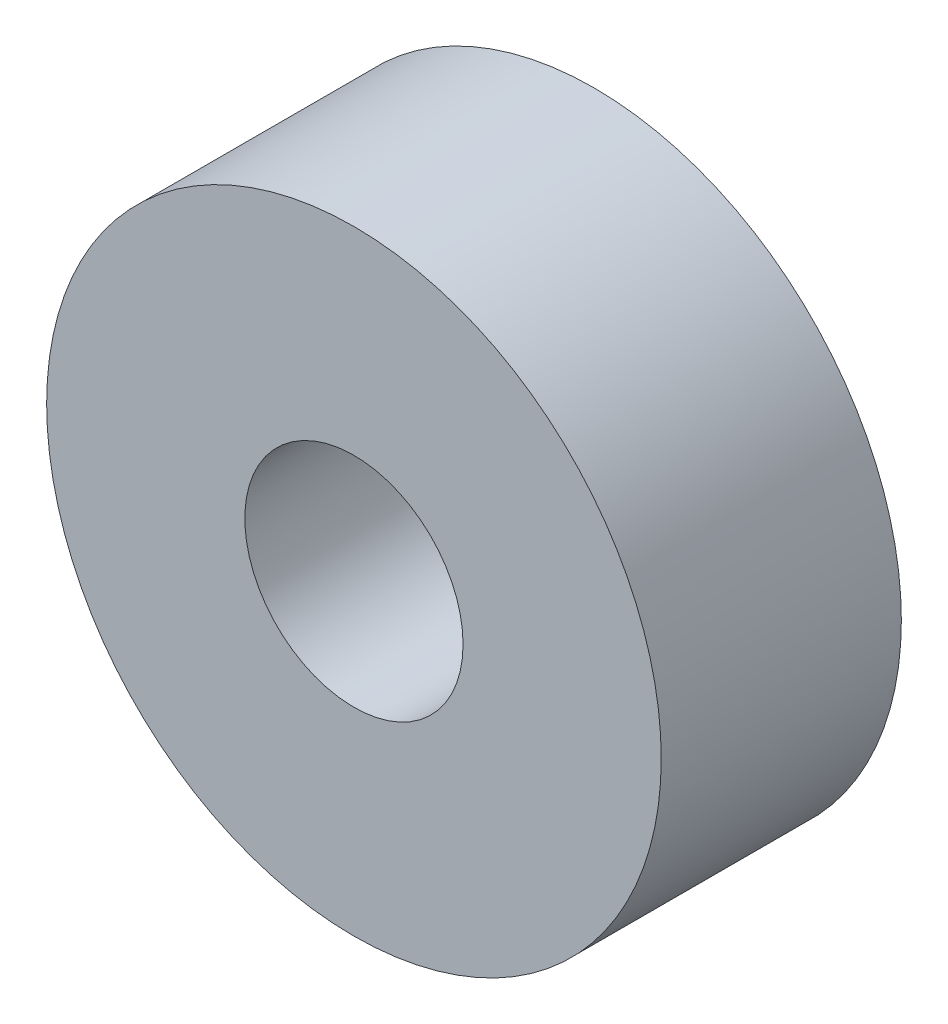
ISO-10303-21;
HEADER;
FILE_DESCRIPTION(('STEP AP214'),'2;1');
FILE_NAME('part.step','',(''),(''),'','','');
FILE_SCHEMA(('AUTOMOTIVE_DESIGN { 1 0 10303 214 1 1 1 1 }'));
ENDSEC;
DATA;
#1=APPLICATION_CONTEXT('core data for automotive mechanical design processes');
#2=APPLICATION_PROTOCOL_DEFINITION('international standard','automotive_design',2000,#1);
#3=PRODUCT_CONTEXT('',#1,'mechanical');
#4=PRODUCT('Part','Part','',(#3));
#5=PRODUCT_RELATED_PRODUCT_CATEGORY('part','',(#4));
#6=PRODUCT_DEFINITION_FORMATION('','',#4);
#7=PRODUCT_DEFINITION_CONTEXT('part definition',#1,'design');
#8=PRODUCT_DEFINITION('design','',#6,#7);
#9=PRODUCT_DEFINITION_SHAPE('','',#8);
#10=(LENGTH_UNIT() NAMED_UNIT(*) SI_UNIT(.MILLI.,.METRE.));
#11=(NAMED_UNIT(*) PLANE_ANGLE_UNIT() SI_UNIT($,.RADIAN.));
#12=(NAMED_UNIT(*) SI_UNIT($,.STERADIAN.) SOLID_ANGLE_UNIT());
#13=UNCERTAINTY_MEASURE_WITH_UNIT(LENGTH_MEASURE(1.E-05),#10,'distance_accuracy_value','');
#14=(GEOMETRIC_REPRESENTATION_CONTEXT(3) GLOBAL_UNCERTAINTY_ASSIGNED_CONTEXT((#13)) GLOBAL_UNIT_ASSIGNED_CONTEXT((#10,
#11,#12)) REPRESENTATION_CONTEXT('',''));
#15=CARTESIAN_POINT('',(0.,0.,0.));
#16=DIRECTION('',(0.,0.,1.));
#17=DIRECTION('',(1.,0.,0.));
#18=AXIS2_PLACEMENT_3D('',#15,#16,#17);
#19=CARTESIAN_POINT('',(0.,0.,8.73252));
#20=DIRECTION('',(0.,0.,1.));
#21=DIRECTION('',(1.,0.,0.));
#22=AXIS2_PLACEMENT_3D('',#19,#20,#21);
#23=PLANE('',#22);
#24=CARTESIAN_POINT('',(0.,0.,8.73252));
#25=DIRECTION('',(0.,0.,1.));
#26=DIRECTION('',(1.,0.,0.));
#27=AXIS2_PLACEMENT_3D('',#24,#25,#26);
#28=CIRCLE('',#27,11.176);
#29=CARTESIAN_POINT('',(11.176,0.,8.73252));
#30=VERTEX_POINT('',#29);
#31=EDGE_CURVE('E10',#30,#30,#28,.T.);
#32=ORIENTED_EDGE('',*,*,#31,.T.);
#33=EDGE_LOOP('',(#32));
#34=FACE_BOUND('',#33,.T.);
#35=CARTESIAN_POINT('',(0.,0.,8.73252));
#36=DIRECTION('',(0.,0.,1.));
#37=DIRECTION('',(1.,0.,0.));
#38=AXIS2_PLACEMENT_3D('',#35,#36,#37);
#39=CIRCLE('',#38,3.96875);
#40=CARTESIAN_POINT('',(3.96875,0.,8.73252));
#41=VERTEX_POINT('',#40);
#42=EDGE_CURVE('E43',#41,#41,#39,.T.);
#43=ORIENTED_EDGE('',*,*,#42,.F.);
#44=EDGE_LOOP('',(#43));
#45=FACE_BOUND('',#44,.T.);
#46=ADVANCED_FACE('F32',(#34,#45),#23,.T.);
#47=CARTESIAN_POINT('',(0.,0.,0.));
#48=DIRECTION('',(0.,0.,1.));
#49=DIRECTION('',(1.,0.,0.));
#50=AXIS2_PLACEMENT_3D('',#47,#48,#49);
#51=PLANE('',#50);
#52=CARTESIAN_POINT('',(0.,0.,0.));
#53=DIRECTION('',(0.,0.,1.));
#54=DIRECTION('',(1.,0.,0.));
#55=AXIS2_PLACEMENT_3D('',#52,#53,#54);
#56=CIRCLE('',#55,11.176);
#57=CARTESIAN_POINT('',(11.176,0.,0.));
#58=VERTEX_POINT('',#57);
#59=EDGE_CURVE('E36',#58,#58,#56,.T.);
#60=ORIENTED_EDGE('',*,*,#59,.F.);
#61=EDGE_LOOP('',(#60));
#62=FACE_BOUND('',#61,.T.);
#63=CARTESIAN_POINT('',(0.,0.,0.));
#64=DIRECTION('',(0.,0.,1.));
#65=DIRECTION('',(1.,0.,0.));
#66=AXIS2_PLACEMENT_3D('',#63,#64,#65);
#67=CIRCLE('',#66,3.96875);
#68=CARTESIAN_POINT('',(3.96875,0.,0.));
#69=VERTEX_POINT('',#68);
#70=EDGE_CURVE('E45',#69,#69,#67,.T.);
#71=ORIENTED_EDGE('',*,*,#70,.T.);
#72=EDGE_LOOP('',(#71));
#73=FACE_BOUND('',#72,.T.);
#74=ADVANCED_FACE('F55',(#62,#73),#51,.F.);
#75=CARTESIAN_POINT('',(0.,0.,8.73252));
#76=DIRECTION('',(0.,0.,-1.));
#77=DIRECTION('',(-1.,0.,0.));
#78=AXIS2_PLACEMENT_3D('',#75,#76,#77);
#79=CYLINDRICAL_SURFACE('',#78,11.176);
#80=ORIENTED_EDGE('',*,*,#31,.F.);
#81=EDGE_LOOP('',(#80));
#82=FACE_BOUND('',#81,.T.);
#83=ORIENTED_EDGE('',*,*,#59,.T.);
#84=EDGE_LOOP('',(#83));
#85=FACE_BOUND('',#84,.T.);
#86=ADVANCED_FACE('F34',(#82,#85),#79,.T.);
#87=CARTESIAN_POINT('',(0.,0.,8.73252));
#88=DIRECTION('',(0.,0.,-1.));
#89=DIRECTION('',(-1.,0.,0.));
#90=AXIS2_PLACEMENT_3D('',#87,#88,#89);
#91=CYLINDRICAL_SURFACE('',#90,3.96875);
#92=ORIENTED_EDGE('',*,*,#42,.T.);
#93=EDGE_LOOP('',(#92));
#94=FACE_BOUND('',#93,.T.);
#95=ORIENTED_EDGE('',*,*,#70,.F.);
#96=EDGE_LOOP('',(#95));
#97=FACE_BOUND('',#96,.T.);
#98=ADVANCED_FACE('F51',(#94,#97),#91,.F.);
#99=CLOSED_SHELL('',(#46,#74,#86,#98));
#100=MANIFOLD_SOLID_BREP('B2',#99);
#101=ADVANCED_BREP_SHAPE_REPRESENTATION('',(#18,#100),#14);
#102=SHAPE_DEFINITION_REPRESENTATION(#9,#101);
ENDSEC;
END-ISO-10303-21;
